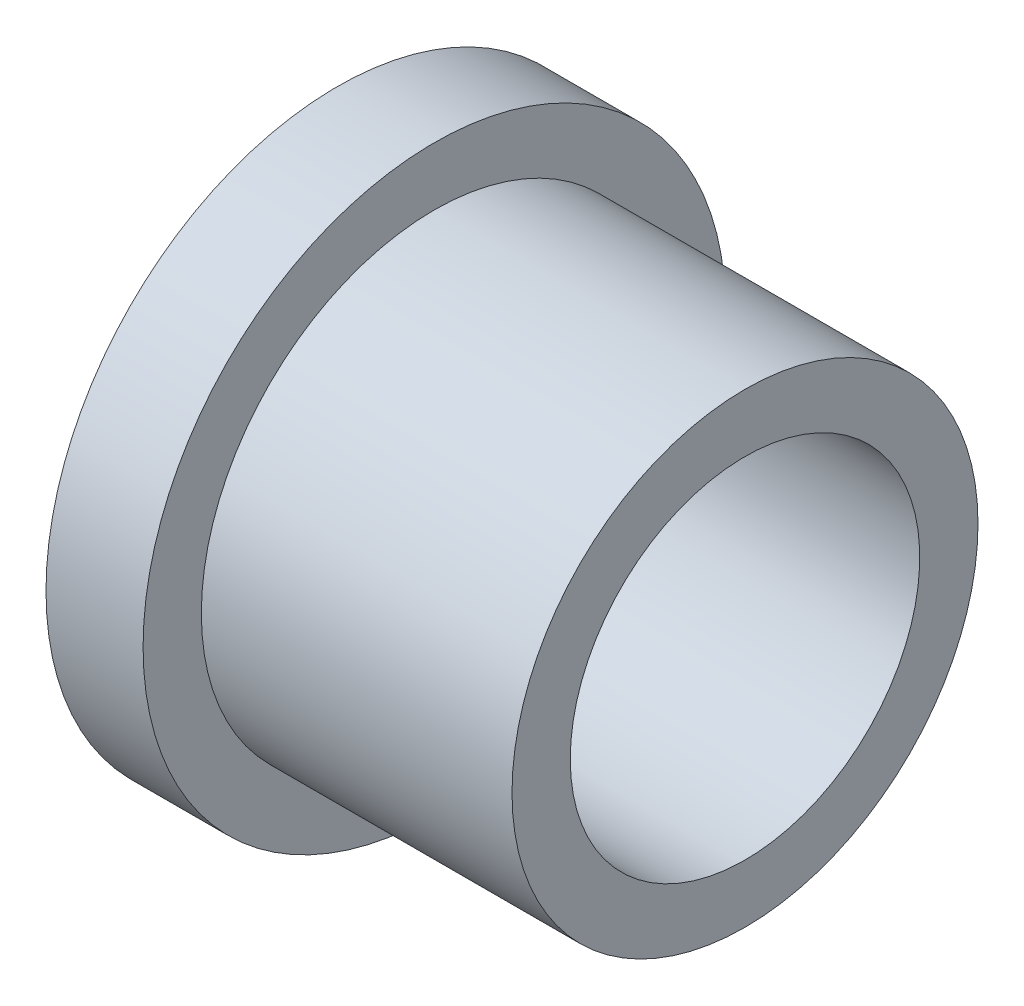
ISO-10303-21;
HEADER;
FILE_DESCRIPTION(('STEP AP214'),'2;1');
FILE_NAME('part.step','',(''),(''),'','','');
FILE_SCHEMA(('AUTOMOTIVE_DESIGN { 1 0 10303 214 1 1 1 1 }'));
ENDSEC;
DATA;
#1=APPLICATION_CONTEXT('core data for automotive mechanical design processes');
#2=APPLICATION_PROTOCOL_DEFINITION('international standard','automotive_design',2000,#1);
#3=PRODUCT_CONTEXT('',#1,'mechanical');
#4=PRODUCT('Part','Part','',(#3));
#5=PRODUCT_RELATED_PRODUCT_CATEGORY('part','',(#4));
#6=PRODUCT_DEFINITION_FORMATION('','',#4);
#7=PRODUCT_DEFINITION_CONTEXT('part definition',#1,'design');
#8=PRODUCT_DEFINITION('design','',#6,#7);
#9=PRODUCT_DEFINITION_SHAPE('','',#8);
#10=(LENGTH_UNIT() NAMED_UNIT(*) SI_UNIT(.MILLI.,.METRE.));
#11=(NAMED_UNIT(*) PLANE_ANGLE_UNIT() SI_UNIT($,.RADIAN.));
#12=(NAMED_UNIT(*) SI_UNIT($,.STERADIAN.) SOLID_ANGLE_UNIT());
#13=UNCERTAINTY_MEASURE_WITH_UNIT(LENGTH_MEASURE(1.E-05),#10,'distance_accuracy_value','');
#14=(GEOMETRIC_REPRESENTATION_CONTEXT(3) GLOBAL_UNCERTAINTY_ASSIGNED_CONTEXT((#13)) GLOBAL_UNIT_ASSIGNED_CONTEXT((#10,
#11,#12)) REPRESENTATION_CONTEXT('',''));
#15=CARTESIAN_POINT('',(0.,0.,0.));
#16=DIRECTION('',(0.,0.,1.));
#17=DIRECTION('',(1.,0.,0.));
#18=AXIS2_PLACEMENT_3D('',#15,#16,#17);
#19=CARTESIAN_POINT('',(0.,15.,0.));
#20=DIRECTION('',(1.,0.,0.));
#21=DIRECTION('',(0.,0.,-1.));
#22=AXIS2_PLACEMENT_3D('',#19,#20,#21);
#23=PLANE('',#22);
#24=CARTESIAN_POINT('',(0.,0.,0.));
#25=DIRECTION('',(-1.,0.,0.));
#26=DIRECTION('',(0.,0.,1.));
#27=AXIS2_PLACEMENT_3D('',#24,#25,#26);
#28=CIRCLE('',#27,9.);
#29=CARTESIAN_POINT('',(0.,0.,9.));
#30=VERTEX_POINT('',#29);
#31=EDGE_CURVE('E10',#30,#30,#28,.T.);
#32=ORIENTED_EDGE('',*,*,#31,.F.);
#33=EDGE_LOOP('',(#32));
#34=FACE_BOUND('',#33,.T.);
#35=CARTESIAN_POINT('',(0.,0.,0.));
#36=DIRECTION('',(-1.,0.,0.));
#37=DIRECTION('',(0.,0.,1.));
#38=AXIS2_PLACEMENT_3D('',#35,#36,#37);
#39=CIRCLE('',#38,15.);
#40=CARTESIAN_POINT('',(0.,0.,15.));
#41=VERTEX_POINT('',#40);
#42=EDGE_CURVE('E53',#41,#41,#39,.T.);
#43=ORIENTED_EDGE('',*,*,#42,.T.);
#44=EDGE_LOOP('',(#43));
#45=FACE_BOUND('',#44,.T.);
#46=ADVANCED_FACE('F31',(#34,#45),#23,.F.);
#47=CARTESIAN_POINT('',(0.,0.,0.));
#48=DIRECTION('',(-1.,0.,0.));
#49=DIRECTION('',(0.,0.,1.));
#50=AXIS2_PLACEMENT_3D('',#47,#48,#49);
#51=CYLINDRICAL_SURFACE('',#50,9.);
#52=CARTESIAN_POINT('',(21.,0.,0.));
#53=DIRECTION('',(-1.,0.,0.));
#54=DIRECTION('',(0.,0.,1.));
#55=AXIS2_PLACEMENT_3D('',#52,#53,#54);
#56=CIRCLE('',#55,9.);
#57=CARTESIAN_POINT('',(21.,0.,9.));
#58=VERTEX_POINT('',#57);
#59=EDGE_CURVE('E37',#58,#58,#56,.T.);
#60=ORIENTED_EDGE('',*,*,#59,.F.);
#61=EDGE_LOOP('',(#60));
#62=FACE_BOUND('',#61,.T.);
#63=ORIENTED_EDGE('',*,*,#31,.T.);
#64=EDGE_LOOP('',(#63));
#65=FACE_BOUND('',#64,.T.);
#66=ADVANCED_FACE('F78',(#62,#65),#51,.F.);
#67=CARTESIAN_POINT('',(21.,9.,0.));
#68=DIRECTION('',(-1.,0.,0.));
#69=DIRECTION('',(0.,0.,1.));
#70=AXIS2_PLACEMENT_3D('',#67,#68,#69);
#71=PLANE('',#70);
#72=CARTESIAN_POINT('',(21.,0.,0.));
#73=DIRECTION('',(-1.,0.,0.));
#74=DIRECTION('',(0.,0.,1.));
#75=AXIS2_PLACEMENT_3D('',#72,#73,#74);
#76=CIRCLE('',#75,12.);
#77=CARTESIAN_POINT('',(21.,0.,12.));
#78=VERTEX_POINT('',#77);
#79=EDGE_CURVE('E41',#78,#78,#76,.T.);
#80=ORIENTED_EDGE('',*,*,#79,.F.);
#81=EDGE_LOOP('',(#80));
#82=FACE_BOUND('',#81,.T.);
#83=ORIENTED_EDGE('',*,*,#59,.T.);
#84=EDGE_LOOP('',(#83));
#85=FACE_BOUND('',#84,.T.);
#86=ADVANCED_FACE('F73',(#82,#85),#71,.F.);
#87=CARTESIAN_POINT('',(0.,0.,0.));
#88=DIRECTION('',(-1.,0.,0.));
#89=DIRECTION('',(0.,0.,1.));
#90=AXIS2_PLACEMENT_3D('',#87,#88,#89);
#91=CYLINDRICAL_SURFACE('',#90,12.);
#92=CARTESIAN_POINT('',(5.,0.,0.));
#93=DIRECTION('',(-1.,0.,0.));
#94=DIRECTION('',(0.,0.,1.));
#95=AXIS2_PLACEMENT_3D('',#92,#93,#94);
#96=CIRCLE('',#95,12.);
#97=CARTESIAN_POINT('',(5.,0.,12.));
#98=VERTEX_POINT('',#97);
#99=EDGE_CURVE('E45',#98,#98,#96,.T.);
#100=ORIENTED_EDGE('',*,*,#99,.F.);
#101=EDGE_LOOP('',(#100));
#102=FACE_BOUND('',#101,.T.);
#103=ORIENTED_EDGE('',*,*,#79,.T.);
#104=EDGE_LOOP('',(#103));
#105=FACE_BOUND('',#104,.T.);
#106=ADVANCED_FACE('F67',(#102,#105),#91,.T.);
#107=CARTESIAN_POINT('',(5.,12.,0.));
#108=DIRECTION('',(-1.,0.,0.));
#109=DIRECTION('',(0.,0.,1.));
#110=AXIS2_PLACEMENT_3D('',#107,#108,#109);
#111=PLANE('',#110);
#112=CARTESIAN_POINT('',(5.,0.,0.));
#113=DIRECTION('',(-1.,0.,0.));
#114=DIRECTION('',(0.,0.,1.));
#115=AXIS2_PLACEMENT_3D('',#112,#113,#114);
#116=CIRCLE('',#115,15.);
#117=CARTESIAN_POINT('',(5.,0.,15.));
#118=VERTEX_POINT('',#117);
#119=EDGE_CURVE('E50',#118,#118,#116,.T.);
#120=ORIENTED_EDGE('',*,*,#119,.F.);
#121=EDGE_LOOP('',(#120));
#122=FACE_BOUND('',#121,.T.);
#123=ORIENTED_EDGE('',*,*,#99,.T.);
#124=EDGE_LOOP('',(#123));
#125=FACE_BOUND('',#124,.T.);
#126=ADVANCED_FACE('F61',(#122,#125),#111,.F.);
#127=CARTESIAN_POINT('',(0.,0.,0.));
#128=DIRECTION('',(-1.,0.,0.));
#129=DIRECTION('',(0.,0.,1.));
#130=AXIS2_PLACEMENT_3D('',#127,#128,#129);
#131=CYLINDRICAL_SURFACE('',#130,15.);
#132=ORIENTED_EDGE('',*,*,#42,.F.);
#133=EDGE_LOOP('',(#132));
#134=FACE_BOUND('',#133,.T.);
#135=ORIENTED_EDGE('',*,*,#119,.T.);
#136=EDGE_LOOP('',(#135));
#137=FACE_BOUND('',#136,.T.);
#138=ADVANCED_FACE('F58',(#134,#137),#131,.T.);
#139=CLOSED_SHELL('',(#46,#66,#86,#106,#126,#138));
#140=MANIFOLD_SOLID_BREP('B2',#139);
#141=ADVANCED_BREP_SHAPE_REPRESENTATION('',(#18,#140),#14);
#142=SHAPE_DEFINITION_REPRESENTATION(#9,#141);
ENDSEC;
END-ISO-10303-21;
